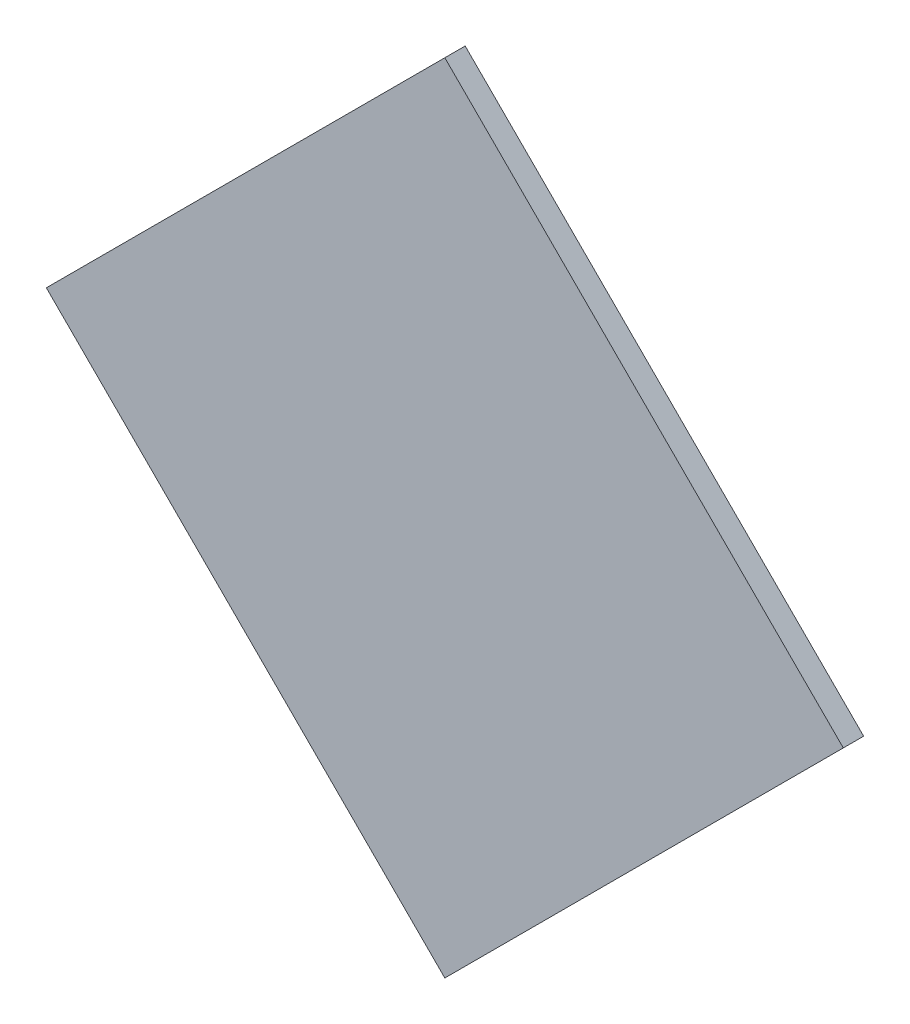
ISO-10303-21;
HEADER;
FILE_DESCRIPTION(('STEP AP214'),'2;1');
FILE_NAME('part.step','',(''),(''),'','','');
FILE_SCHEMA(('AUTOMOTIVE_DESIGN { 1 0 10303 214 1 1 1 1 }'));
ENDSEC;
DATA;
#1=APPLICATION_CONTEXT('core data for automotive mechanical design processes');
#2=APPLICATION_PROTOCOL_DEFINITION('international standard','automotive_design',2000,#1);
#3=PRODUCT_CONTEXT('',#1,'mechanical');
#4=PRODUCT('Part','Part','',(#3));
#5=PRODUCT_RELATED_PRODUCT_CATEGORY('part','',(#4));
#6=PRODUCT_DEFINITION_FORMATION('','',#4);
#7=PRODUCT_DEFINITION_CONTEXT('part definition',#1,'design');
#8=PRODUCT_DEFINITION('design','',#6,#7);
#9=PRODUCT_DEFINITION_SHAPE('','',#8);
#10=(LENGTH_UNIT() NAMED_UNIT(*) SI_UNIT(.MILLI.,.METRE.));
#11=(NAMED_UNIT(*) PLANE_ANGLE_UNIT() SI_UNIT($,.RADIAN.));
#12=(NAMED_UNIT(*) SI_UNIT($,.STERADIAN.) SOLID_ANGLE_UNIT());
#13=UNCERTAINTY_MEASURE_WITH_UNIT(LENGTH_MEASURE(1.E-05),#10,'distance_accuracy_value','');
#14=(GEOMETRIC_REPRESENTATION_CONTEXT(3) GLOBAL_UNCERTAINTY_ASSIGNED_CONTEXT((#13)) GLOBAL_UNIT_ASSIGNED_CONTEXT((#10,
#11,#12)) REPRESENTATION_CONTEXT('',''));
#15=CARTESIAN_POINT('',(0.,0.,0.));
#16=DIRECTION('',(0.,0.,1.));
#17=DIRECTION('',(1.,0.,0.));
#18=AXIS2_PLACEMENT_3D('',#15,#16,#17);
#19=CARTESIAN_POINT('',(6.253942,6.033942,0.76487));
#20=DIRECTION('',(0.,0.,-1.));
#21=DIRECTION('',(-1.,0.,0.));
#22=AXIS2_PLACEMENT_3D('',#19,#20,#21);
#23=PLANE('',#22);
#24=DIRECTION('',(0.707106781186548,0.707106781186548,0.));
#25=VECTOR('',#24,1.);
#26=CARTESIAN_POINT('',(5.582190667,6.033942,0.76487));
#27=LINE('',#26,#25);
#28=CARTESIAN_POINT('',(5.582190667,6.033942,0.76487));
#29=VERTEX_POINT('',#28);
#30=CARTESIAN_POINT('',(6.253942,6.705693333,0.76487));
#31=VERTEX_POINT('',#30);
#32=EDGE_CURVE('E55',#29,#31,#27,.T.);
#33=ORIENTED_EDGE('',*,*,#32,.T.);
#34=DIRECTION('',(0.707106781186548,-0.707106781186548,0.));
#35=VECTOR('',#34,1.);
#36=CARTESIAN_POINT('',(6.253942,6.705693333,0.76487));
#37=LINE('',#36,#35);
#38=CARTESIAN_POINT('',(6.925693333,6.033942,0.76487));
#39=VERTEX_POINT('',#38);
#40=EDGE_CURVE('E57',#31,#39,#37,.T.);
#41=ORIENTED_EDGE('',*,*,#40,.T.);
#42=DIRECTION('',(-0.707106781186548,-0.707106781186548,0.));
#43=VECTOR('',#42,1.);
#44=CARTESIAN_POINT('',(6.925693333,6.033942,0.76487));
#45=LINE('',#44,#43);
#46=CARTESIAN_POINT('',(6.253942,5.362190667,0.76487));
#47=VERTEX_POINT('',#46);
#48=EDGE_CURVE('E20',#39,#47,#45,.T.);
#49=ORIENTED_EDGE('',*,*,#48,.T.);
#50=DIRECTION('',(-0.707106781186548,0.707106781186548,0.));
#51=VECTOR('',#50,1.);
#52=CARTESIAN_POINT('',(6.253942,5.362190667,0.76487));
#53=LINE('',#52,#51);
#54=EDGE_CURVE('E80',#47,#29,#53,.T.);
#55=ORIENTED_EDGE('',*,*,#54,.T.);
#56=EDGE_LOOP('',(#33,#41,#49,#55));
#57=FACE_BOUND('',#56,.T.);
#58=ADVANCED_FACE('F17',(#57),#23,.T.);
#59=CARTESIAN_POINT('',(6.925693333,6.033942,0.76487));
#60=DIRECTION('',(-0.707106781186548,0.707106781186548,0.));
#61=DIRECTION('',(-0.707106781186548,-0.707106781186548,0.));
#62=AXIS2_PLACEMENT_3D('',#59,#60,#61);
#63=PLANE('',#62);
#64=DIRECTION('',(0.,0.,1.));
#65=VECTOR('',#64,1.);
#66=CARTESIAN_POINT('',(6.253942,5.362190667,0.76487));
#67=LINE('',#66,#65);
#68=CARTESIAN_POINT('',(6.253942,5.362190667,0.79916));
#69=VERTEX_POINT('',#68);
#70=EDGE_CURVE('E68',#69,#47,#67,.F.);
#71=ORIENTED_EDGE('',*,*,#70,.T.);
#72=ORIENTED_EDGE('',*,*,#48,.F.);
#73=DIRECTION('',(0.,0.,1.));
#74=VECTOR('',#73,1.);
#75=CARTESIAN_POINT('',(6.925693333,6.033942,0.76487));
#76=LINE('',#75,#74);
#77=CARTESIAN_POINT('',(6.925693333,6.033942,0.79916));
#78=VERTEX_POINT('',#77);
#79=EDGE_CURVE('E63',#39,#78,#76,.T.);
#80=ORIENTED_EDGE('',*,*,#79,.T.);
#81=DIRECTION('',(0.707106781186548,0.707106781186547,0.));
#82=VECTOR('',#81,1.);
#83=CARTESIAN_POINT('',(6.253942,5.362190667,0.79916));
#84=LINE('',#83,#82);
#85=EDGE_CURVE('E83',#69,#78,#84,.T.);
#86=ORIENTED_EDGE('',*,*,#85,.F.);
#87=EDGE_LOOP('',(#71,#72,#80,#86));
#88=FACE_BOUND('',#87,.T.);
#89=ADVANCED_FACE('F65',(#88),#63,.F.);
#90=CARTESIAN_POINT('',(6.253942,6.705693333,0.76487));
#91=DIRECTION('',(-0.707106781186548,-0.707106781186548,0.));
#92=DIRECTION('',(0.707106781186548,-0.707106781186548,0.));
#93=AXIS2_PLACEMENT_3D('',#90,#91,#92);
#94=PLANE('',#93);
#95=ORIENTED_EDGE('',*,*,#79,.F.);
#96=ORIENTED_EDGE('',*,*,#40,.F.);
#97=DIRECTION('',(0.,0.,1.));
#98=VECTOR('',#97,1.);
#99=CARTESIAN_POINT('',(6.253942,6.705693333,0.76487));
#100=LINE('',#99,#98);
#101=CARTESIAN_POINT('',(6.253942,6.705693333,0.79916));
#102=VERTEX_POINT('',#101);
#103=EDGE_CURVE('E75',#31,#102,#100,.T.);
#104=ORIENTED_EDGE('',*,*,#103,.T.);
#105=DIRECTION('',(-0.707106781186547,0.707106781186548,0.));
#106=VECTOR('',#105,1.);
#107=CARTESIAN_POINT('',(6.925693333,6.033942,0.79916));
#108=LINE('',#107,#106);
#109=EDGE_CURVE('E72',#78,#102,#108,.T.);
#110=ORIENTED_EDGE('',*,*,#109,.F.);
#111=EDGE_LOOP('',(#95,#96,#104,#110));
#112=FACE_BOUND('',#111,.T.);
#113=ADVANCED_FACE('F70',(#112),#94,.F.);
#114=CARTESIAN_POINT('',(5.582190667,6.033942,0.76487));
#115=DIRECTION('',(0.707106781186548,-0.707106781186548,0.));
#116=DIRECTION('',(0.707106781186548,0.707106781186548,0.));
#117=AXIS2_PLACEMENT_3D('',#114,#115,#116);
#118=PLANE('',#117);
#119=ORIENTED_EDGE('',*,*,#103,.F.);
#120=ORIENTED_EDGE('',*,*,#32,.F.);
#121=DIRECTION('',(0.,0.,1.));
#122=VECTOR('',#121,1.);
#123=CARTESIAN_POINT('',(5.582190667,6.033942,0.76487));
#124=LINE('',#123,#122);
#125=CARTESIAN_POINT('',(5.582190667,6.033942,0.79916));
#126=VERTEX_POINT('',#125);
#127=EDGE_CURVE('E35',#29,#126,#124,.T.);
#128=ORIENTED_EDGE('',*,*,#127,.T.);
#129=DIRECTION('',(-0.707106781186547,-0.707106781186548,0.));
#130=VECTOR('',#129,1.);
#131=CARTESIAN_POINT('',(6.253942,6.705693333,0.79916));
#132=LINE('',#131,#130);
#133=EDGE_CURVE('E26',#102,#126,#132,.T.);
#134=ORIENTED_EDGE('',*,*,#133,.F.);
#135=EDGE_LOOP('',(#119,#120,#128,#134));
#136=FACE_BOUND('',#135,.T.);
#137=ADVANCED_FACE('F89',(#136),#118,.F.);
#138=CARTESIAN_POINT('',(6.253942,5.362190667,0.76487));
#139=DIRECTION('',(0.707106781186548,0.707106781186548,0.));
#140=DIRECTION('',(-0.707106781186548,0.707106781186548,0.));
#141=AXIS2_PLACEMENT_3D('',#138,#139,#140);
#142=PLANE('',#141);
#143=ORIENTED_EDGE('',*,*,#127,.F.);
#144=ORIENTED_EDGE('',*,*,#54,.F.);
#145=ORIENTED_EDGE('',*,*,#70,.F.);
#146=DIRECTION('',(0.707106781186548,-0.707106781186547,0.));
#147=VECTOR('',#146,1.);
#148=CARTESIAN_POINT('',(5.582190667,6.033942,0.79916));
#149=LINE('',#148,#147);
#150=EDGE_CURVE('E11',#126,#69,#149,.T.);
#151=ORIENTED_EDGE('',*,*,#150,.F.);
#152=EDGE_LOOP('',(#143,#144,#145,#151));
#153=FACE_BOUND('',#152,.T.);
#154=ADVANCED_FACE('F91',(#153),#142,.F.);
#155=CARTESIAN_POINT('',(6.253942,6.033942,0.79916));
#156=DIRECTION('',(0.,0.,1.));
#157=DIRECTION('',(0.,-1.,0.));
#158=AXIS2_PLACEMENT_3D('',#155,#156,#157);
#159=PLANE('',#158);
#160=ORIENTED_EDGE('',*,*,#133,.T.);
#161=ORIENTED_EDGE('',*,*,#150,.T.);
#162=ORIENTED_EDGE('',*,*,#85,.T.);
#163=ORIENTED_EDGE('',*,*,#109,.T.);
#164=EDGE_LOOP('',(#160,#161,#162,#163));
#165=FACE_BOUND('',#164,.T.);
#166=ADVANCED_FACE('F88',(#165),#159,.T.);
#167=CLOSED_SHELL('',(#58,#89,#113,#137,#154,#166));
#168=MANIFOLD_SOLID_BREP('B1',#167);
#169=ADVANCED_BREP_SHAPE_REPRESENTATION('',(#18,#168),#14);
#170=SHAPE_DEFINITION_REPRESENTATION(#9,#169);
ENDSEC;
END-ISO-10303-21;
